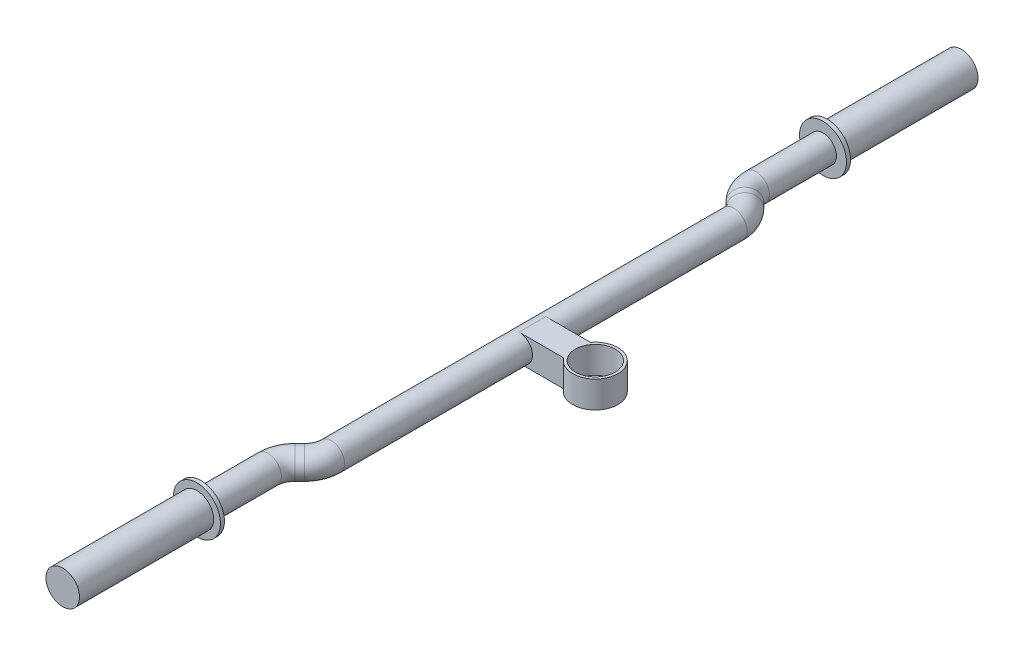
ISO-10303-21;
HEADER;
FILE_DESCRIPTION(('STEP AP214'),'2;1');
FILE_NAME('part.step','',(''),(''),'','','');
FILE_SCHEMA(('AUTOMOTIVE_DESIGN { 1 0 10303 214 1 1 1 1 }'));
ENDSEC;
DATA;
#1=APPLICATION_CONTEXT('core data for automotive mechanical design processes');
#2=APPLICATION_PROTOCOL_DEFINITION('international standard','automotive_design',2000,#1);
#3=PRODUCT_CONTEXT('',#1,'mechanical');
#4=PRODUCT('Part','Part','',(#3));
#5=PRODUCT_RELATED_PRODUCT_CATEGORY('part','',(#4));
#6=PRODUCT_DEFINITION_FORMATION('','',#4);
#7=PRODUCT_DEFINITION_CONTEXT('part definition',#1,'design');
#8=PRODUCT_DEFINITION('design','',#6,#7);
#9=PRODUCT_DEFINITION_SHAPE('','',#8);
#10=(LENGTH_UNIT() NAMED_UNIT(*) SI_UNIT(.MILLI.,.METRE.));
#11=(NAMED_UNIT(*) PLANE_ANGLE_UNIT() SI_UNIT($,.RADIAN.));
#12=(NAMED_UNIT(*) SI_UNIT($,.STERADIAN.) SOLID_ANGLE_UNIT());
#13=UNCERTAINTY_MEASURE_WITH_UNIT(LENGTH_MEASURE(1.E-05),#10,'distance_accuracy_value','');
#14=(GEOMETRIC_REPRESENTATION_CONTEXT(3) GLOBAL_UNCERTAINTY_ASSIGNED_CONTEXT((#13)) GLOBAL_UNIT_ASSIGNED_CONTEXT((#10,
#11,#12)) REPRESENTATION_CONTEXT('',''));
#15=CARTESIAN_POINT('',(0.,0.,0.));
#16=DIRECTION('',(0.,0.,1.));
#17=DIRECTION('',(1.,0.,0.));
#18=AXIS2_PLACEMENT_3D('',#15,#16,#17);
#19=CARTESIAN_POINT('',(-62.1012626584708,10.,-234.819805153395));
#20=DIRECTION('',(0.,0.,1.));
#21=DIRECTION('',(1.,0.,0.));
#22=AXIS2_PLACEMENT_3D('',#19,#20,#21);
#23=CYLINDRICAL_SURFACE('',#22,17.5);
#24=CARTESIAN_POINT('',(-62.1012626584708,10.,-234.819805153395));
#25=DIRECTION('',(0.,0.,-1.));
#26=DIRECTION('',(-1.,0.,0.));
#27=AXIS2_PLACEMENT_3D('',#24,#25,#26);
#28=CIRCLE('',#27,17.5);
#29=CARTESIAN_POINT('',(-79.6012626584708,10.,-234.819805153395));
#30=VERTEX_POINT('',#29);
#31=EDGE_CURVE('E55',#30,#30,#28,.T.);
#32=ORIENTED_EDGE('',*,*,#31,.F.);
#33=EDGE_LOOP('',(#32));
#34=FACE_BOUND('',#33,.T.);
#35=CARTESIAN_POINT('',(-62.1012626584708,10.,-231.819805153395));
#36=DIRECTION('',(0.,0.,-1.));
#37=DIRECTION('',(-1.,0.,0.));
#38=AXIS2_PLACEMENT_3D('',#35,#36,#37);
#39=CIRCLE('',#38,17.5);
#40=CARTESIAN_POINT('',(-79.6012626584708,10.,-231.819805153395));
#41=VERTEX_POINT('',#40);
#42=EDGE_CURVE('E51',#41,#41,#39,.T.);
#43=ORIENTED_EDGE('',*,*,#42,.T.);
#44=EDGE_LOOP('',(#43));
#45=FACE_BOUND('',#44,.T.);
#46=ADVANCED_FACE('F48',(#34,#45),#23,.T.);
#47=CARTESIAN_POINT('',(-62.1012626584708,10.,-234.819805153395));
#48=DIRECTION('',(0.,0.,-1.));
#49=DIRECTION('',(-1.,0.,0.));
#50=AXIS2_PLACEMENT_3D('',#47,#48,#49);
#51=PLANE('',#50);
#52=CARTESIAN_POINT('',(-62.1012626584708,10.,-234.819805153395));
#53=DIRECTION('',(0.,0.,-1.));
#54=DIRECTION('',(-1.,0.,0.));
#55=AXIS2_PLACEMENT_3D('',#52,#53,#54);
#56=CIRCLE('',#55,12.5);
#57=CARTESIAN_POINT('',(-74.6012626584708,10.,-234.819805153395));
#58=VERTEX_POINT('',#57);
#59=EDGE_CURVE('E11',#58,#58,#56,.T.);
#60=ORIENTED_EDGE('',*,*,#59,.F.);
#61=EDGE_LOOP('',(#60));
#62=FACE_BOUND('',#61,.T.);
#63=ORIENTED_EDGE('',*,*,#31,.T.);
#64=EDGE_LOOP('',(#63));
#65=FACE_BOUND('',#64,.T.);
#66=ADVANCED_FACE('F72',(#62,#65),#51,.T.);
#67=CARTESIAN_POINT('',(-62.1012626584708,10.,-231.819805153395));
#68=DIRECTION('',(0.,0.,-1.));
#69=DIRECTION('',(-1.,0.,0.));
#70=AXIS2_PLACEMENT_3D('',#67,#68,#69);
#71=PLANE('',#70);
#72=ORIENTED_EDGE('',*,*,#42,.F.);
#73=EDGE_LOOP('',(#72));
#74=FACE_BOUND('',#73,.T.);
#75=ADVANCED_FACE('F69',(#74),#71,.F.);
#76=CARTESIAN_POINT('',(-62.1012626584708,10.,-334.819805153395));
#77=DIRECTION('',(0.,0.,1.));
#78=DIRECTION('',(1.,0.,0.));
#79=AXIS2_PLACEMENT_3D('',#76,#77,#78);
#80=CYLINDRICAL_SURFACE('',#79,12.5);
#81=CARTESIAN_POINT('',(-62.1012626584708,10.,-334.819805153395));
#82=DIRECTION('',(0.,0.,-1.));
#83=DIRECTION('',(-1.,0.,0.));
#84=AXIS2_PLACEMENT_3D('',#81,#82,#83);
#85=CIRCLE('',#84,12.5);
#86=CARTESIAN_POINT('',(-74.6012626584708,10.,-334.819805153395));
#87=VERTEX_POINT('',#86);
#88=EDGE_CURVE('E61',#87,#87,#85,.T.);
#89=ORIENTED_EDGE('',*,*,#88,.F.);
#90=EDGE_LOOP('',(#89));
#91=FACE_BOUND('',#90,.T.);
#92=ORIENTED_EDGE('',*,*,#59,.T.);
#93=EDGE_LOOP('',(#92));
#94=FACE_BOUND('',#93,.T.);
#95=ADVANCED_FACE('F71',(#91,#94),#80,.T.);
#96=CARTESIAN_POINT('',(-62.1012626584708,10.,-334.819805153395));
#97=DIRECTION('',(0.,0.,-1.));
#98=DIRECTION('',(-1.,0.,0.));
#99=AXIS2_PLACEMENT_3D('',#96,#97,#98);
#100=PLANE('',#99);
#101=ORIENTED_EDGE('',*,*,#88,.T.);
#102=EDGE_LOOP('',(#101));
#103=FACE_BOUND('',#102,.T.);
#104=ADVANCED_FACE('F77',(#103),#100,.T.);
#105=CLOSED_SHELL('',(#46,#66,#75,#95,#104));
#106=MANIFOLD_SOLID_BREP('B2',#105);
#107=CARTESIAN_POINT('',(-62.1012626584708,10.,234.819805153395));
#108=DIRECTION('',(0.,0.,-1.));
#109=DIRECTION('',(-1.,0.,0.));
#110=AXIS2_PLACEMENT_3D('',#107,#108,#109);
#111=CYLINDRICAL_SURFACE('',#110,17.5);
#112=CARTESIAN_POINT('',(-62.1012626584708,10.,234.819805153395));
#113=DIRECTION('',(0.,0.,1.));
#114=DIRECTION('',(1.,0.,0.));
#115=AXIS2_PLACEMENT_3D('',#112,#113,#114);
#116=CIRCLE('',#115,17.5);
#117=CARTESIAN_POINT('',(-44.6012626584708,10.,234.819805153395));
#118=VERTEX_POINT('',#117);
#119=EDGE_CURVE('E144',#118,#118,#116,.T.);
#120=ORIENTED_EDGE('',*,*,#119,.F.);
#121=EDGE_LOOP('',(#120));
#122=FACE_BOUND('',#121,.T.);
#123=CARTESIAN_POINT('',(-62.1012626584708,10.,231.819805153395));
#124=DIRECTION('',(0.,0.,1.));
#125=DIRECTION('',(1.,0.,0.));
#126=AXIS2_PLACEMENT_3D('',#123,#124,#125);
#127=CIRCLE('',#126,17.5);
#128=CARTESIAN_POINT('',(-44.6012626584708,10.,231.819805153395));
#129=VERTEX_POINT('',#128);
#130=EDGE_CURVE('E140',#129,#129,#127,.T.);
#131=ORIENTED_EDGE('',*,*,#130,.T.);
#132=EDGE_LOOP('',(#131));
#133=FACE_BOUND('',#132,.T.);
#134=ADVANCED_FACE('F137',(#122,#133),#111,.T.);
#135=CARTESIAN_POINT('',(-62.1012626584708,10.,234.819805153395));
#136=DIRECTION('',(0.,0.,1.));
#137=DIRECTION('',(1.,0.,0.));
#138=AXIS2_PLACEMENT_3D('',#135,#136,#137);
#139=PLANE('',#138);
#140=CARTESIAN_POINT('',(-62.1012626584708,10.,234.819805153395));
#141=DIRECTION('',(0.,0.,1.));
#142=DIRECTION('',(1.,0.,0.));
#143=AXIS2_PLACEMENT_3D('',#140,#141,#142);
#144=CIRCLE('',#143,12.5);
#145=CARTESIAN_POINT('',(-49.6012626584708,10.,234.819805153395));
#146=VERTEX_POINT('',#145);
#147=EDGE_CURVE('E47',#146,#146,#144,.T.);
#148=ORIENTED_EDGE('',*,*,#147,.F.);
#149=EDGE_LOOP('',(#148));
#150=FACE_BOUND('',#149,.T.);
#151=ORIENTED_EDGE('',*,*,#119,.T.);
#152=EDGE_LOOP('',(#151));
#153=FACE_BOUND('',#152,.T.);
#154=ADVANCED_FACE('F161',(#150,#153),#139,.T.);
#155=CARTESIAN_POINT('',(-62.1012626584708,10.,231.819805153395));
#156=DIRECTION('',(0.,0.,1.));
#157=DIRECTION('',(1.,0.,0.));
#158=AXIS2_PLACEMENT_3D('',#155,#156,#157);
#159=PLANE('',#158);
#160=ORIENTED_EDGE('',*,*,#130,.F.);
#161=EDGE_LOOP('',(#160));
#162=FACE_BOUND('',#161,.T.);
#163=ADVANCED_FACE('F158',(#162),#159,.F.);
#164=CARTESIAN_POINT('',(-62.1012626584708,10.,334.819805153395));
#165=DIRECTION('',(0.,0.,-1.));
#166=DIRECTION('',(-1.,0.,0.));
#167=AXIS2_PLACEMENT_3D('',#164,#165,#166);
#168=CYLINDRICAL_SURFACE('',#167,12.5);
#169=CARTESIAN_POINT('',(-62.1012626584708,10.,334.819805153395));
#170=DIRECTION('',(0.,0.,1.));
#171=DIRECTION('',(1.,0.,0.));
#172=AXIS2_PLACEMENT_3D('',#169,#170,#171);
#173=CIRCLE('',#172,12.5);
#174=CARTESIAN_POINT('',(-49.6012626584708,10.,334.819805153395));
#175=VERTEX_POINT('',#174);
#176=EDGE_CURVE('E150',#175,#175,#173,.T.);
#177=ORIENTED_EDGE('',*,*,#176,.F.);
#178=EDGE_LOOP('',(#177));
#179=FACE_BOUND('',#178,.T.);
#180=ORIENTED_EDGE('',*,*,#147,.T.);
#181=EDGE_LOOP('',(#180));
#182=FACE_BOUND('',#181,.T.);
#183=ADVANCED_FACE('F160',(#179,#182),#168,.T.);
#184=CARTESIAN_POINT('',(-62.1012626584708,10.,334.819805153395));
#185=DIRECTION('',(0.,0.,1.));
#186=DIRECTION('',(1.,0.,0.));
#187=AXIS2_PLACEMENT_3D('',#184,#185,#186);
#188=PLANE('',#187);
#189=ORIENTED_EDGE('',*,*,#176,.T.);
#190=EDGE_LOOP('',(#189));
#191=FACE_BOUND('',#190,.T.);
#192=ADVANCED_FACE('F166',(#191),#188,.T.);
#193=CLOSED_SHELL('',(#134,#154,#163,#183,#192));
#194=MANIFOLD_SOLID_BREP('B6',#193);
#195=CARTESIAN_POINT('',(-62.1012626584708,10.,231.819805153395));
#196=DIRECTION('',(0.,0.,1.));
#197=DIRECTION('',(1.,0.,0.));
#198=AXIS2_PLACEMENT_3D('',#195,#196,#197);
#199=PLANE('',#198);
#200=CARTESIAN_POINT('',(-62.1012626584708,10.,231.819805153395));
#201=DIRECTION('',(0.,0.,1.));
#202=DIRECTION('',(1.,0.,0.));
#203=AXIS2_PLACEMENT_3D('',#200,#201,#202);
#204=CIRCLE('',#203,10.);
#205=CARTESIAN_POINT('',(-52.1012626584708,10.,231.819805153395));
#206=VERTEX_POINT('',#205);
#207=EDGE_CURVE('E136',#206,#206,#204,.T.);
#208=ORIENTED_EDGE('',*,*,#207,.T.);
#209=EDGE_LOOP('',(#208));
#210=FACE_BOUND('',#209,.T.);
#211=ADVANCED_FACE('F227',(#210),#199,.T.);
#212=CARTESIAN_POINT('',(-46.85,10.,0.));
#213=DIRECTION('',(0.,0.,1.));
#214=DIRECTION('',(1.,0.,0.));
#215=AXIS2_PLACEMENT_3D('',#212,#213,#214);
#216=CYLINDRICAL_SURFACE('',#215,10.);
#217=CARTESIAN_POINT('',(-46.85,10.,150.));
#218=DIRECTION('',(0.,0.,1.));
#219=DIRECTION('',(1.,0.,0.));
#220=AXIS2_PLACEMENT_3D('',#217,#218,#219);
#221=CIRCLE('',#220,10.);
#222=CARTESIAN_POINT('',(-36.85,10.,150.));
#223=VERTEX_POINT('',#222);
#224=EDGE_CURVE('E246',#223,#223,#221,.T.);
#225=ORIENTED_EDGE('',*,*,#224,.F.);
#226=EDGE_LOOP('',(#225));
#227=FACE_BOUND('',#226,.T.);
#228=CARTESIAN_POINT('',(-46.85,10.,-150.));
#229=DIRECTION('',(0.,0.,1.));
#230=DIRECTION('',(1.,0.,0.));
#231=AXIS2_PLACEMENT_3D('',#228,#229,#230);
#232=CIRCLE('',#231,10.);
#233=CARTESIAN_POINT('',(-36.85,10.,-150.));
#234=VERTEX_POINT('',#233);
#235=EDGE_CURVE('E258',#234,#234,#232,.T.);
#236=ORIENTED_EDGE('',*,*,#235,.T.);
#237=EDGE_LOOP('',(#236));
#238=FACE_BOUND('',#237,.T.);
#239=ADVANCED_FACE('F283',(#227,#238),#216,.T.);
#240=CARTESIAN_POINT('',(-66.85,10.,150.));
#241=DIRECTION('',(0.,-1.,0.));
#242=DIRECTION('',(0.,0.,-1.));
#243=AXIS2_PLACEMENT_3D('',#240,#241,#242);
#244=TOROIDAL_SURFACE('',#243,20.,10.);
#245=CARTESIAN_POINT('',(-52.7078643762691,10.,164.142135623731));
#246=DIRECTION('',(-0.707106781186548,0.,0.707106781186547));
#247=DIRECTION('',(0.707106781186547,0.,0.707106781186548));
#248=AXIS2_PLACEMENT_3D('',#245,#246,#247);
#249=CIRCLE('',#248,10.);
#250=CARTESIAN_POINT('',(-45.6367965644036,10.,171.213203435596));
#251=VERTEX_POINT('',#250);
#252=EDGE_CURVE('E241',#251,#251,#249,.T.);
#253=CARTESIAN_POINT('',(-66.85,10.,150.));
#254=DIRECTION('',(0.,-1.,0.));
#255=DIRECTION('',(0.,0.,-1.));
#256=AXIS2_PLACEMENT_3D('',#253,#254,#255);
#257=CIRCLE('',#256,30.);
#258=EDGE_CURVE('',#223,#251,#257,.T.);
#259=ORIENTED_EDGE('',*,*,#224,.T.);
#260=ORIENTED_EDGE('',*,*,#252,.F.);
#261=ORIENTED_EDGE('',*,*,#258,.T.);
#262=ORIENTED_EDGE('',*,*,#258,.F.);
#263=EDGE_LOOP('',(#259,#261,#260,#262));
#264=FACE_BOUND('',#263,.T.);
#265=ADVANCED_FACE('F287',(#264),#244,.T.);
#266=CARTESIAN_POINT('',(-52.7078643762691,10.,164.142135623731));
#267=DIRECTION('',(-0.707106781186544,0.,0.707106781186551));
#268=DIRECTION('',(0.707106781186551,0.,0.707106781186544));
#269=AXIS2_PLACEMENT_3D('',#266,#267,#268);
#270=CYLINDRICAL_SURFACE('',#269,10.);
#271=CARTESIAN_POINT('',(-56.2433982822018,10.,167.677669529664));
#272=DIRECTION('',(-0.707106781186544,0.,0.707106781186551));
#273=DIRECTION('',(0.707106781186551,0.,0.707106781186544));
#274=AXIS2_PLACEMENT_3D('',#271,#272,#273);
#275=CIRCLE('',#274,10.);
#276=CARTESIAN_POINT('',(-63.3144660940673,10.,160.606601717798));
#277=VERTEX_POINT('',#276);
#278=EDGE_CURVE('E237',#277,#277,#275,.T.);
#279=ORIENTED_EDGE('',*,*,#278,.F.);
#280=EDGE_LOOP('',(#279));
#281=FACE_BOUND('',#280,.T.);
#282=ORIENTED_EDGE('',*,*,#252,.T.);
#283=EDGE_LOOP('',(#282));
#284=FACE_BOUND('',#283,.T.);
#285=ADVANCED_FACE('F293',(#281,#284),#270,.T.);
#286=CARTESIAN_POINT('',(-42.1012626584708,10.,181.819805153395));
#287=DIRECTION('',(0.,1.,0.));
#288=DIRECTION('',(0.,0.,1.));
#289=AXIS2_PLACEMENT_3D('',#286,#287,#288);
#290=TOROIDAL_SURFACE('',#289,20.,10.);
#291=CARTESIAN_POINT('',(-62.1012626584708,10.,181.819805153395));
#292=DIRECTION('',(0.,0.,1.));
#293=DIRECTION('',(1.,0.,0.));
#294=AXIS2_PLACEMENT_3D('',#291,#292,#293);
#295=CIRCLE('',#294,10.);
#296=CARTESIAN_POINT('',(-72.1012626584708,10.,181.819805153395));
#297=VERTEX_POINT('',#296);
#298=EDGE_CURVE('E233',#297,#297,#295,.T.);
#299=CARTESIAN_POINT('',(-42.1012626584708,10.,181.819805153395));
#300=DIRECTION('',(0.,1.,0.));
#301=DIRECTION('',(0.,0.,1.));
#302=AXIS2_PLACEMENT_3D('',#299,#300,#301);
#303=CIRCLE('',#302,30.);
#304=EDGE_CURVE('',#277,#297,#303,.T.);
#305=ORIENTED_EDGE('',*,*,#278,.T.);
#306=ORIENTED_EDGE('',*,*,#298,.F.);
#307=ORIENTED_EDGE('',*,*,#304,.T.);
#308=ORIENTED_EDGE('',*,*,#304,.F.);
#309=EDGE_LOOP('',(#305,#307,#306,#308));
#310=FACE_BOUND('',#309,.T.);
#311=ADVANCED_FACE('F280',(#310),#290,.T.);
#312=CARTESIAN_POINT('',(-62.1012626584708,10.,181.819805153395));
#313=DIRECTION('',(0.,0.,1.));
#314=DIRECTION('',(1.,0.,0.));
#315=AXIS2_PLACEMENT_3D('',#312,#313,#314);
#316=CYLINDRICAL_SURFACE('',#315,10.);
#317=ORIENTED_EDGE('',*,*,#207,.F.);
#318=EDGE_LOOP('',(#317));
#319=FACE_BOUND('',#318,.T.);
#320=ORIENTED_EDGE('',*,*,#298,.T.);
#321=EDGE_LOOP('',(#320));
#322=FACE_BOUND('',#321,.T.);
#323=ADVANCED_FACE('F271',(#319,#322),#316,.T.);
#324=CARTESIAN_POINT('',(-62.1012626584708,10.,-231.819805153395));
#325=DIRECTION('',(0.,0.,-1.));
#326=DIRECTION('',(1.,0.,0.));
#327=AXIS2_PLACEMENT_3D('',#324,#325,#326);
#328=PLANE('',#327);
#329=CARTESIAN_POINT('',(-62.1012626584708,10.,-231.819805153395));
#330=DIRECTION('',(0.,0.,1.));
#331=DIRECTION('',(1.,0.,0.));
#332=AXIS2_PLACEMENT_3D('',#329,#330,#331);
#333=CIRCLE('',#332,10.);
#334=CARTESIAN_POINT('',(-52.1012626584708,10.,-231.819805153395));
#335=VERTEX_POINT('',#334);
#336=EDGE_CURVE('E261',#335,#335,#333,.T.);
#337=ORIENTED_EDGE('',*,*,#336,.F.);
#338=EDGE_LOOP('',(#337));
#339=FACE_BOUND('',#338,.T.);
#340=ADVANCED_FACE('F268',(#339),#328,.T.);
#341=CARTESIAN_POINT('',(-66.85,10.,-150.));
#342=DIRECTION('',(0.,-1.,0.));
#343=DIRECTION('',(0.,0.,1.));
#344=AXIS2_PLACEMENT_3D('',#341,#342,#343);
#345=TOROIDAL_SURFACE('',#344,20.,10.);
#346=CARTESIAN_POINT('',(-52.7078643762691,10.,-164.142135623731));
#347=DIRECTION('',(0.707106781186548,0.,0.707106781186547));
#348=DIRECTION('',(0.707106781186547,0.,-0.707106781186548));
#349=AXIS2_PLACEMENT_3D('',#346,#347,#348);
#350=CIRCLE('',#349,10.);
#351=CARTESIAN_POINT('',(-45.6367965644036,10.,-171.213203435596));
#352=VERTEX_POINT('',#351);
#353=EDGE_CURVE('E255',#352,#352,#350,.T.);
#354=CARTESIAN_POINT('',(-66.85,10.,-150.));
#355=DIRECTION('',(0.,-1.,0.));
#356=DIRECTION('',(0.,0.,1.));
#357=AXIS2_PLACEMENT_3D('',#354,#355,#356);
#358=CIRCLE('',#357,30.);
#359=EDGE_CURVE('',#352,#234,#358,.T.);
#360=ORIENTED_EDGE('',*,*,#353,.T.);
#361=ORIENTED_EDGE('',*,*,#235,.F.);
#362=ORIENTED_EDGE('',*,*,#359,.T.);
#363=ORIENTED_EDGE('',*,*,#359,.F.);
#364=EDGE_LOOP('',(#360,#362,#361,#363));
#365=FACE_BOUND('',#364,.T.);
#366=ADVANCED_FACE('F270',(#365),#345,.T.);
#367=CARTESIAN_POINT('',(-52.7078643762691,10.,-164.142135623731));
#368=DIRECTION('',(-0.707106781186544,0.,-0.707106781186551));
#369=DIRECTION('',(0.707106781186551,0.,-0.707106781186544));
#370=AXIS2_PLACEMENT_3D('',#367,#368,#369);
#371=CYLINDRICAL_SURFACE('',#370,10.);
#372=CARTESIAN_POINT('',(-56.2433982822018,10.,-167.677669529664));
#373=DIRECTION('',(0.707106781186544,0.,0.707106781186551));
#374=DIRECTION('',(0.707106781186551,0.,-0.707106781186544));
#375=AXIS2_PLACEMENT_3D('',#372,#373,#374);
#376=CIRCLE('',#375,10.);
#377=CARTESIAN_POINT('',(-63.3144660940673,10.,-160.606601717798));
#378=VERTEX_POINT('',#377);
#379=EDGE_CURVE('E252',#378,#378,#376,.T.);
#380=ORIENTED_EDGE('',*,*,#379,.T.);
#381=EDGE_LOOP('',(#380));
#382=FACE_BOUND('',#381,.T.);
#383=ORIENTED_EDGE('',*,*,#353,.F.);
#384=EDGE_LOOP('',(#383));
#385=FACE_BOUND('',#384,.T.);
#386=ADVANCED_FACE('F277',(#382,#385),#371,.T.);
#387=CARTESIAN_POINT('',(-42.1012626584708,10.,-181.819805153395));
#388=DIRECTION('',(0.,1.,0.));
#389=DIRECTION('',(0.,0.,-1.));
#390=AXIS2_PLACEMENT_3D('',#387,#388,#389);
#391=TOROIDAL_SURFACE('',#390,20.,10.);
#392=CARTESIAN_POINT('',(-62.1012626584708,10.,-181.819805153395));
#393=DIRECTION('',(0.,0.,1.));
#394=DIRECTION('',(1.,0.,0.));
#395=AXIS2_PLACEMENT_3D('',#392,#393,#394);
#396=CIRCLE('',#395,10.);
#397=CARTESIAN_POINT('',(-72.1012626584708,10.,-181.819805153395));
#398=VERTEX_POINT('',#397);
#399=EDGE_CURVE('E249',#398,#398,#396,.T.);
#400=CARTESIAN_POINT('',(-42.1012626584708,10.,-181.819805153395));
#401=DIRECTION('',(0.,1.,0.));
#402=DIRECTION('',(0.,0.,-1.));
#403=AXIS2_PLACEMENT_3D('',#400,#401,#402);
#404=CIRCLE('',#403,30.);
#405=EDGE_CURVE('',#398,#378,#404,.T.);
#406=ORIENTED_EDGE('',*,*,#399,.T.);
#407=ORIENTED_EDGE('',*,*,#379,.F.);
#408=ORIENTED_EDGE('',*,*,#405,.T.);
#409=ORIENTED_EDGE('',*,*,#405,.F.);
#410=EDGE_LOOP('',(#406,#408,#407,#409));
#411=FACE_BOUND('',#410,.T.);
#412=ADVANCED_FACE('F348',(#411),#391,.T.);
#413=CARTESIAN_POINT('',(-62.1012626584708,10.,-181.819805153395));
#414=DIRECTION('',(0.,0.,-1.));
#415=DIRECTION('',(1.,0.,0.));
#416=AXIS2_PLACEMENT_3D('',#413,#414,#415);
#417=CYLINDRICAL_SURFACE('',#416,10.);
#418=ORIENTED_EDGE('',*,*,#336,.T.);
#419=EDGE_LOOP('',(#418));
#420=FACE_BOUND('',#419,.T.);
#421=ORIENTED_EDGE('',*,*,#399,.F.);
#422=EDGE_LOOP('',(#421));
#423=FACE_BOUND('',#422,.T.);
#424=ADVANCED_FACE('F265',(#420,#423),#417,.T.);
#425=CLOSED_SHELL('',(#211,#239,#265,#285,#311,#323,#340,#366,#386,#412,#424));
#426=MANIFOLD_SOLID_BREP('B42',#425);
#427=CARTESIAN_POINT('',(0.,20.,0.));
#428=DIRECTION('',(0.,1.,0.));
#429=DIRECTION('',(0.,0.,1.));
#430=AXIS2_PLACEMENT_3D('',#427,#428,#429);
#431=PLANE('',#430);
#432=CARTESIAN_POINT('',(0.,20.,0.));
#433=DIRECTION('',(0.,1.,0.));
#434=DIRECTION('',(0.,0.,1.));
#435=AXIS2_PLACEMENT_3D('',#432,#433,#434);
#436=CIRCLE('',#435,16.85);
#437=CARTESIAN_POINT('',(-13.5618029774805,20.,10.));
#438=VERTEX_POINT('',#437);
#439=CARTESIAN_POINT('',(-13.5618029774805,20.,-10.));
#440=VERTEX_POINT('',#439);
#441=EDGE_CURVE('E225',#438,#440,#436,.T.);
#442=ORIENTED_EDGE('',*,*,#441,.T.);
#443=DIRECTION('',(-1.,0.,0.));
#444=VECTOR('',#443,1.);
#445=CARTESIAN_POINT('',(-13.5618029774805,20.,-10.));
#446=LINE('',#445,#444);
#447=CARTESIAN_POINT('',(-46.85,20.,-9.99999999999999));
#448=VERTEX_POINT('',#447);
#449=EDGE_CURVE('E453',#440,#448,#446,.T.);
#450=ORIENTED_EDGE('',*,*,#449,.T.);
#451=DIRECTION('',(0.,0.,1.));
#452=VECTOR('',#451,1.);
#453=CARTESIAN_POINT('',(-46.85,20.,-9.99999999999999));
#454=LINE('',#453,#452);
#455=CARTESIAN_POINT('',(-46.85,20.,10.));
#456=VERTEX_POINT('',#455);
#457=EDGE_CURVE('E461',#448,#456,#454,.T.);
#458=ORIENTED_EDGE('',*,*,#457,.T.);
#459=DIRECTION('',(1.,0.,0.));
#460=VECTOR('',#459,1.);
#461=CARTESIAN_POINT('',(-46.85,20.,10.));
#462=LINE('',#461,#460);
#463=EDGE_CURVE('E467',#456,#438,#462,.T.);
#464=ORIENTED_EDGE('',*,*,#463,.T.);
#465=EDGE_LOOP('',(#442,#450,#458,#464));
#466=FACE_BOUND('',#465,.T.);
#467=CARTESIAN_POINT('',(0.,20.,0.));
#468=DIRECTION('',(0.,1.,0.));
#469=DIRECTION('',(0.,0.,1.));
#470=AXIS2_PLACEMENT_3D('',#467,#468,#469);
#471=CIRCLE('',#470,14.85);
#472=CARTESIAN_POINT('',(0.,20.,14.85));
#473=VERTEX_POINT('',#472);
#474=EDGE_CURVE('E483',#473,#473,#471,.T.);
#475=ORIENTED_EDGE('',*,*,#474,.F.);
#476=EDGE_LOOP('',(#475));
#477=FACE_BOUND('',#476,.T.);
#478=ADVANCED_FACE('F410',(#466,#477),#431,.T.);
#479=CARTESIAN_POINT('',(0.,0.,0.));
#480=DIRECTION('',(0.,1.,0.));
#481=DIRECTION('',(0.,0.,1.));
#482=AXIS2_PLACEMENT_3D('',#479,#480,#481);
#483=PLANE('',#482);
#484=CARTESIAN_POINT('',(0.,0.,0.));
#485=DIRECTION('',(0.,1.,0.));
#486=DIRECTION('',(0.,0.,1.));
#487=AXIS2_PLACEMENT_3D('',#484,#485,#486);
#488=CIRCLE('',#487,16.85);
#489=CARTESIAN_POINT('',(-13.5618029774805,0.,10.));
#490=VERTEX_POINT('',#489);
#491=CARTESIAN_POINT('',(-13.5618029774805,0.,-10.));
#492=VERTEX_POINT('',#491);
#493=EDGE_CURVE('E414',#490,#492,#488,.T.);
#494=ORIENTED_EDGE('',*,*,#493,.F.);
#495=DIRECTION('',(-1.,0.,0.));
#496=VECTOR('',#495,1.);
#497=CARTESIAN_POINT('',(-46.85,0.,10.));
#498=LINE('',#497,#496);
#499=CARTESIAN_POINT('',(-46.85,0.,10.));
#500=VERTEX_POINT('',#499);
#501=EDGE_CURVE('E472',#490,#500,#498,.T.);
#502=ORIENTED_EDGE('',*,*,#501,.T.);
#503=DIRECTION('',(0.,0.,-1.));
#504=VECTOR('',#503,1.);
#505=CARTESIAN_POINT('',(-46.85,0.,-9.99999999999999));
#506=LINE('',#505,#504);
#507=CARTESIAN_POINT('',(-46.85,0.,-9.99999999999999));
#508=VERTEX_POINT('',#507);
#509=EDGE_CURVE('E478',#500,#508,#506,.T.);
#510=ORIENTED_EDGE('',*,*,#509,.T.);
#511=DIRECTION('',(1.,0.,0.));
#512=VECTOR('',#511,1.);
#513=CARTESIAN_POINT('',(-13.5618029774805,0.,-10.));
#514=LINE('',#513,#512);
#515=EDGE_CURVE('E454',#508,#492,#514,.T.);
#516=ORIENTED_EDGE('',*,*,#515,.T.);
#517=EDGE_LOOP('',(#494,#502,#510,#516));
#518=FACE_BOUND('',#517,.T.);
#519=CARTESIAN_POINT('',(0.,0.,0.));
#520=DIRECTION('',(0.,1.,0.));
#521=DIRECTION('',(0.,0.,1.));
#522=AXIS2_PLACEMENT_3D('',#519,#520,#521);
#523=CIRCLE('',#522,14.85);
#524=CARTESIAN_POINT('',(0.,0.,14.85));
#525=VERTEX_POINT('',#524);
#526=EDGE_CURVE('E482',#525,#525,#523,.T.);
#527=ORIENTED_EDGE('',*,*,#526,.T.);
#528=EDGE_LOOP('',(#527));
#529=FACE_BOUND('',#528,.T.);
#530=ADVANCED_FACE('F489',(#518,#529),#483,.F.);
#531=CARTESIAN_POINT('',(0.,20.,0.));
#532=DIRECTION('',(0.,-1.,0.));
#533=DIRECTION('',(0.,0.,-1.));
#534=AXIS2_PLACEMENT_3D('',#531,#532,#533);
#535=CYLINDRICAL_SURFACE('',#534,16.85);
#536=ORIENTED_EDGE('',*,*,#441,.F.);
#537=DIRECTION('',(0.,1.,0.));
#538=VECTOR('',#537,1.);
#539=CARTESIAN_POINT('',(-13.5618029774805,-38.834315508453,10.));
#540=LINE('',#539,#538);
#541=EDGE_CURVE('E476',#490,#438,#540,.T.);
#542=ORIENTED_EDGE('',*,*,#541,.F.);
#543=ORIENTED_EDGE('',*,*,#493,.T.);
#544=DIRECTION('',(0.,1.,0.));
#545=VECTOR('',#544,1.);
#546=CARTESIAN_POINT('',(-13.5618029774805,-38.834315508453,-10.));
#547=LINE('',#546,#545);
#548=EDGE_CURVE('E458',#492,#440,#547,.T.);
#549=ORIENTED_EDGE('',*,*,#548,.T.);
#550=EDGE_LOOP('',(#536,#542,#543,#549));
#551=FACE_BOUND('',#550,.T.);
#552=ADVANCED_FACE('F412',(#551),#535,.T.);
#553=CARTESIAN_POINT('',(0.,20.,0.));
#554=DIRECTION('',(0.,-1.,0.));
#555=DIRECTION('',(0.,0.,-1.));
#556=AXIS2_PLACEMENT_3D('',#553,#554,#555);
#557=CYLINDRICAL_SURFACE('',#556,14.85);
#558=ORIENTED_EDGE('',*,*,#474,.T.);
#559=EDGE_LOOP('',(#558));
#560=FACE_BOUND('',#559,.T.);
#561=ORIENTED_EDGE('',*,*,#526,.F.);
#562=EDGE_LOOP('',(#561));
#563=FACE_BOUND('',#562,.T.);
#564=ADVANCED_FACE('F491',(#560,#563),#557,.F.);
#565=CARTESIAN_POINT('',(-46.85,-38.834315508453,10.));
#566=DIRECTION('',(0.,0.,1.));
#567=DIRECTION('',(1.,0.,0.));
#568=AXIS2_PLACEMENT_3D('',#565,#566,#567);
#569=PLANE('',#568);
#570=ORIENTED_EDGE('',*,*,#501,.F.);
#571=ORIENTED_EDGE('',*,*,#541,.T.);
#572=ORIENTED_EDGE('',*,*,#463,.F.);
#573=DIRECTION('',(0.,1.,0.));
#574=VECTOR('',#573,1.);
#575=CARTESIAN_POINT('',(-46.85,-38.834315508453,10.));
#576=LINE('',#575,#574);
#577=EDGE_CURVE('E457',#500,#456,#576,.T.);
#578=ORIENTED_EDGE('',*,*,#577,.F.);
#579=EDGE_LOOP('',(#570,#571,#572,#578));
#580=FACE_BOUND('',#579,.T.);
#581=ADVANCED_FACE('F493',(#580),#569,.T.);
#582=CARTESIAN_POINT('',(-46.85,-38.834315508453,-9.99999999999999));
#583=DIRECTION('',(-1.,0.,0.));
#584=DIRECTION('',(0.,0.,1.));
#585=AXIS2_PLACEMENT_3D('',#582,#583,#584);
#586=PLANE('',#585);
#587=ORIENTED_EDGE('',*,*,#509,.F.);
#588=ORIENTED_EDGE('',*,*,#577,.T.);
#589=ORIENTED_EDGE('',*,*,#457,.F.);
#590=DIRECTION('',(0.,1.,0.));
#591=VECTOR('',#590,1.);
#592=CARTESIAN_POINT('',(-46.85,-38.834315508453,-9.99999999999999));
#593=LINE('',#592,#591);
#594=EDGE_CURVE('E448',#508,#448,#593,.T.);
#595=ORIENTED_EDGE('',*,*,#594,.F.);
#596=EDGE_LOOP('',(#587,#588,#589,#595));
#597=FACE_BOUND('',#596,.T.);
#598=ADVANCED_FACE('F462',(#597),#586,.T.);
#599=CARTESIAN_POINT('',(-13.5618029774805,-38.834315508453,-10.));
#600=DIRECTION('',(0.,0.,-1.));
#601=DIRECTION('',(-1.,0.,0.));
#602=AXIS2_PLACEMENT_3D('',#599,#600,#601);
#603=PLANE('',#602);
#604=ORIENTED_EDGE('',*,*,#515,.F.);
#605=ORIENTED_EDGE('',*,*,#594,.T.);
#606=ORIENTED_EDGE('',*,*,#449,.F.);
#607=ORIENTED_EDGE('',*,*,#548,.F.);
#608=EDGE_LOOP('',(#604,#605,#606,#607));
#609=FACE_BOUND('',#608,.T.);
#610=ADVANCED_FACE('F450',(#609),#603,.T.);
#611=CLOSED_SHELL('',(#478,#530,#552,#564,#581,#598,#610));
#612=MANIFOLD_SOLID_BREP('B131',#611);
#613=ADVANCED_BREP_SHAPE_REPRESENTATION('',(#18,#106,#194,#426,#612),#14);
#614=SHAPE_DEFINITION_REPRESENTATION(#9,#613);
ENDSEC;
END-ISO-10303-21;
